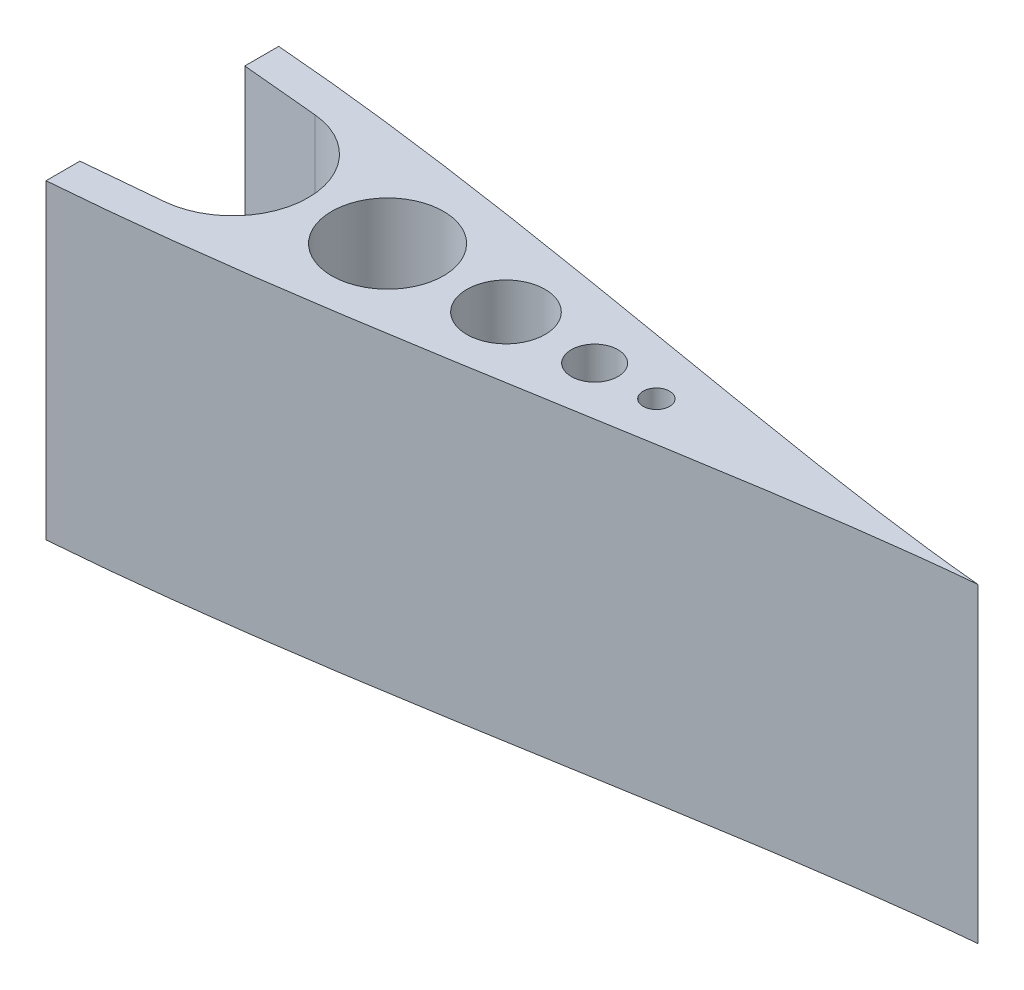
ISO-10303-21;
HEADER;
FILE_DESCRIPTION(('STEP AP214'),'2;1');
FILE_NAME('part.step','',(''),(''),'','','');
FILE_SCHEMA(('AUTOMOTIVE_DESIGN { 1 0 10303 214 1 1 1 1 }'));
ENDSEC;
DATA;
#1=APPLICATION_CONTEXT('core data for automotive mechanical design processes');
#2=APPLICATION_PROTOCOL_DEFINITION('international standard','automotive_design',2000,#1);
#3=PRODUCT_CONTEXT('',#1,'mechanical');
#4=PRODUCT('Part','Part','',(#3));
#5=PRODUCT_RELATED_PRODUCT_CATEGORY('part','',(#4));
#6=PRODUCT_DEFINITION_FORMATION('','',#4);
#7=PRODUCT_DEFINITION_CONTEXT('part definition',#1,'design');
#8=PRODUCT_DEFINITION('design','',#6,#7);
#9=PRODUCT_DEFINITION_SHAPE('','',#8);
#10=(LENGTH_UNIT() NAMED_UNIT(*) SI_UNIT(.MILLI.,.METRE.));
#11=(NAMED_UNIT(*) PLANE_ANGLE_UNIT() SI_UNIT($,.RADIAN.));
#12=(NAMED_UNIT(*) SI_UNIT($,.STERADIAN.) SOLID_ANGLE_UNIT());
#13=UNCERTAINTY_MEASURE_WITH_UNIT(LENGTH_MEASURE(1.E-05),#10,'distance_accuracy_value','');
#14=(GEOMETRIC_REPRESENTATION_CONTEXT(3) GLOBAL_UNCERTAINTY_ASSIGNED_CONTEXT((#13)) GLOBAL_UNIT_ASSIGNED_CONTEXT((#10,
#11,#12)) REPRESENTATION_CONTEXT('',''));
#15=CARTESIAN_POINT('',(0.,0.,0.));
#16=DIRECTION('',(0.,0.,1.));
#17=DIRECTION('',(1.,0.,0.));
#18=AXIS2_PLACEMENT_3D('',#15,#16,#17);
#19=CARTESIAN_POINT('',(1.01618101339085,50.8,-10.8993353954497));
#20=DIRECTION('',(0.0928307105141878,0.,-0.995681906627525));
#21=DIRECTION('',(-0.995681906627525,0.,-0.0928307105141878));
#22=AXIS2_PLACEMENT_3D('',#19,#20,#21);
#23=PLANE('',#22);
#24=DIRECTION('',(0.995681906627525,0.,0.0928307105141878));
#25=VECTOR('',#24,1.);
#26=CARTESIAN_POINT('',(1.01618101339085,50.8,-10.8993353954497));
#27=LINE('',#26,#25);
#28=CARTESIAN_POINT('',(-26.4729833951407,50.8,-13.4622409243139));
#29=VERTEX_POINT('',#28);
#30=CARTESIAN_POINT('',(-13.8473201339051,50.8,-12.2851086660569));
#31=VERTEX_POINT('',#30);
#32=EDGE_CURVE('E156',#29,#31,#27,.T.);
#33=ORIENTED_EDGE('',*,*,#32,.F.);
#34=DIRECTION('',(0.,-1.,0.));
#35=VECTOR('',#34,1.);
#36=CARTESIAN_POINT('',(-26.4729833951407,50.8,-13.4622409243139));
#37=LINE('',#36,#35);
#38=CARTESIAN_POINT('',(-26.4729833951407,0.,-13.4622409243139));
#39=VERTEX_POINT('',#38);
#40=EDGE_CURVE('E222',#29,#39,#37,.T.);
#41=ORIENTED_EDGE('',*,*,#40,.T.);
#42=DIRECTION('',(0.995681906627525,0.,0.0928307105141878));
#43=VECTOR('',#42,1.);
#44=CARTESIAN_POINT('',(1.01618101339085,0.,-10.8993353954496));
#45=LINE('',#44,#43);
#46=CARTESIAN_POINT('',(-13.8473201339051,0.,-12.2851086660568));
#47=VERTEX_POINT('',#46);
#48=EDGE_CURVE('E256',#39,#47,#45,.T.);
#49=ORIENTED_EDGE('',*,*,#48,.T.);
#50=DIRECTION('',(0.,-1.,0.));
#51=VECTOR('',#50,1.);
#52=CARTESIAN_POINT('',(-13.8473201339051,50.8,-12.2851086660569));
#53=LINE('',#52,#51);
#54=EDGE_CURVE('E69',#31,#47,#53,.T.);
#55=ORIENTED_EDGE('',*,*,#54,.F.);
#56=EDGE_LOOP('',(#33,#41,#49,#55));
#57=FACE_BOUND('',#56,.T.);
#58=ADVANCED_FACE('F57',(#57),#23,.F.);
#59=CARTESIAN_POINT('',(-14.9927013632145,50.8,1.11022302462516E-13));
#60=DIRECTION('',(0.,-1.,0.));
#61=DIRECTION('',(0.,0.,-0.999999999999996));
#62=AXIS2_PLACEMENT_3D('',#59,#60,#61);
#63=CYLINDRICAL_SURFACE('',#62,12.338386973073);
#64=CARTESIAN_POINT('',(-14.9927013632145,0.,2.22044604925031E-13));
#65=DIRECTION('',(0.,1.,0.));
#66=DIRECTION('',(0.,0.,0.999999999999996));
#67=AXIS2_PLACEMENT_3D('',#64,#65,#66);
#68=CIRCLE('',#67,12.338386973073);
#69=CARTESIAN_POINT('',(-13.8473201339051,0.,12.285108666058));
#70=VERTEX_POINT('',#69);
#71=EDGE_CURVE('E261',#70,#47,#68,.T.);
#72=ORIENTED_EDGE('',*,*,#71,.F.);
#73=DIRECTION('',(0.,-1.,0.));
#74=VECTOR('',#73,1.);
#75=CARTESIAN_POINT('',(-13.8473201339051,50.8,12.285108666058));
#76=LINE('',#75,#74);
#77=CARTESIAN_POINT('',(-13.8473201339051,50.8,12.285108666058));
#78=VERTEX_POINT('',#77);
#79=EDGE_CURVE('E283',#78,#70,#76,.T.);
#80=ORIENTED_EDGE('',*,*,#79,.F.);
#81=CARTESIAN_POINT('',(-14.9927013632145,50.8,1.11022302462516E-13));
#82=DIRECTION('',(0.,1.,0.));
#83=DIRECTION('',(0.,0.,0.999999999999996));
#84=AXIS2_PLACEMENT_3D('',#81,#82,#83);
#85=CIRCLE('',#84,12.338386973073);
#86=EDGE_CURVE('E162',#78,#31,#85,.T.);
#87=ORIENTED_EDGE('',*,*,#86,.T.);
#88=ORIENTED_EDGE('',*,*,#54,.T.);
#89=EDGE_LOOP('',(#72,#80,#87,#88));
#90=FACE_BOUND('',#89,.T.);
#91=ADVANCED_FACE('F184',(#90),#63,.F.);
#92=CARTESIAN_POINT('',(-106.482983395141,50.7999999999982,-7.35533856044412E-09));
#93=CARTESIAN_POINT('',(-106.481988205194,50.7999999999982,-0.336221446681662));
#94=CARTESIAN_POINT('',(-106.427915569481,50.7999999999982,-1.17247085156813));
#95=CARTESIAN_POINT('',(-106.10595146375,50.7999999999982,-2.6430992686044));
#96=CARTESIAN_POINT('',(-105.314009735291,50.7999999999982,-4.47521740831969));
#97=CARTESIAN_POINT('',(-103.897531118637,50.8,-6.50434841864356));
#98=CARTESIAN_POINT('',(-101.808045378182,50.8,-8.57165133235616));
#99=CARTESIAN_POINT('',(-99.0667178405011,50.8,-10.5675567036547));
#100=CARTESIAN_POINT('',(-95.7198031883861,50.8,-12.426747299612));
#101=CARTESIAN_POINT('',(-91.8173324289491,50.8,-14.1114417112691));
#102=CARTESIAN_POINT('',(-87.4067018354754,50.8,-15.5993181619846));
#103=CARTESIAN_POINT('',(-82.5319070115307,50.8,-16.8771333229446));
#104=CARTESIAN_POINT('',(-77.2341496539681,50.8,-17.9374356197232));
#105=CARTESIAN_POINT('',(-71.5526070979118,50.8,-18.7767405724212));
#106=CARTESIAN_POINT('',(-65.5251476056236,50.8,-19.3954605858547));
#107=CARTESIAN_POINT('',(-59.1885914175652,50.8,-19.7965740301131));
#108=CARTESIAN_POINT('',(-52.579053079844,50.8,-19.9862763161063));
#109=CARTESIAN_POINT('',(-45.7320019639345,50.8,-19.9728658373548));
#110=CARTESIAN_POINT('',(-38.6823636938902,50.8,-19.7673224697509));
#111=CARTESIAN_POINT('',(-31.4645229280412,50.8,-19.3825524779141));
#112=CARTESIAN_POINT('',(-24.1123351486456,50.8,-18.8333174672901));
#113=CARTESIAN_POINT('',(-16.6591158210678,50.8,-18.1360009675589));
#114=CARTESIAN_POINT('',(-9.13763404320478,50.8,-17.308302016677));
#115=CARTESIAN_POINT('',(-1.58011288129378,50.8,-16.3689060143236));
#116=CARTESIAN_POINT('',(5.98177290974777,50.8,-15.3372135342326));
#117=CARTESIAN_POINT('',(13.5168910285406,50.8,-14.2329994071519));
#118=CARTESIAN_POINT('',(20.9946456094976,50.8,-13.0761298482216));
#119=CARTESIAN_POINT('',(28.3849687391637,50.8,-11.8862100008003));
#120=CARTESIAN_POINT('',(35.6583232509189,50.8,-10.6823363143879));
#121=CARTESIAN_POINT('',(42.7857029072654,50.8,-9.4827591236365));
#122=CARTESIAN_POINT('',(49.7386474254295,50.8,-8.30463778684765));
#123=CARTESIAN_POINT('',(56.4892656841134,50.8,-7.16376071809477));
#124=CARTESIAN_POINT('',(63.0102811144397,50.8,-6.07435669901413));
#125=CARTESIAN_POINT('',(69.2750767276782,50.8,-5.04884141157258));
#126=CARTESIAN_POINT('',(75.2577811056108,50.8,-4.09769207062749));
#127=CARTESIAN_POINT('',(80.9333433114543,50.8,-3.22931724888953));
#128=CARTESIAN_POINT('',(86.2776693757115,50.8,-2.44984621283506));
#129=CARTESIAN_POINT('',(91.2676183232579,50.8,-1.76329204938785));
#130=CARTESIAN_POINT('',(95.881607116401,50.8,-1.1712247595822));
#131=CARTESIAN_POINT('',(100.098099776026,50.8,-0.67311916377033));
#132=CARTESIAN_POINT('',(103.673185129137,50.8,-0.290516392494555));
#133=CARTESIAN_POINT('',(105.83614121967,50.8,-0.0817456538573236));
#134=CARTESIAN_POINT('',(106.733370690552,50.8,-7.30038252072518E-09));
#135=B_SPLINE_CURVE_WITH_KNOTS('',3,(#92,#93,#94,#95,#96,#97,#98,#99,#100,#101,#102,#103,#104,
#105,#106,#107,#108,#109,#110,#111,#112,#113,#114,#115,#116,#117,#118,#119,#120,#121,#122,#123,
#124,#125,#126,#127,#128,#129,#130,#131,#132,#133,#134),.UNSPECIFIED.,.F.,.F.,(4,1,1,1,1,1,1,1,
1,1,1,1,1,1,1,1,1,1,1,1,1,1,1,1,1,1,1,1,1,1,1,1,1,1,1,1,1,1,1,1,4),(0.5,0.502166768562745,
0.505390167385713,0.509655974305835,0.514947681887198,0.521244711429097,0.528520886222697,
0.536744945012688,0.545881360311019,0.555890751085959,0.566730118512969,0.578352990409744,
0.59070958813284,0.603747039427916,0.617409572172202,0.631638768029288,0.646373793426418,
0.66155165817642,0.677107482822761,0.692974771091203,0.709085712601986,0.725371443301651,
0.741762353139131,0.758188398075751,0.774579367488477,0.790865214368963,0.806976331929698,
0.822843867373426,0.838400001999155,0.853578261502887,0.868313774347479,0.882543568085681,
0.896206835422454,0.909245173309164,0.921602869650348,0.933227116385514,0.944068236336681,
0.954079898096736,0.963219316327445,0.971447444986932,0.977251073986684),.UNSPECIFIED.);
#136=DIRECTION('',(0.,-1.,0.));
#137=VECTOR('',#136,1.);
#138=SURFACE_OF_LINEAR_EXTRUSION('',#135,#137);
#139=DIRECTION('',(0.,-1.,0.));
#140=VECTOR('',#139,1.);
#141=CARTESIAN_POINT('',(-26.4729833951411,25.4000000000001,-19.0014780591534));
#142=LINE('',#141,#140);
#143=CARTESIAN_POINT('',(-26.4729834006801,0.,-19.001478059586));
#144=VERTEX_POINT('',#143);
#145=CARTESIAN_POINT('',(-26.4729833951411,50.8,-19.0014780591534));
#146=VERTEX_POINT('',#145);
#147=EDGE_CURVE('E91',#144,#146,#142,.F.);
#148=ORIENTED_EDGE('',*,*,#147,.T.);
#149=CARTESIAN_POINT('',(106.733370690552,50.8,7.30038252072518E-09));
#150=VERTEX_POINT('',#149);
#151=EDGE_CURVE('E157',#146,#150,#135,.T.);
#152=ORIENTED_EDGE('',*,*,#151,.T.);
#153=DIRECTION('',(0.,-1.,0.));
#154=VECTOR('',#153,1.);
#155=CARTESIAN_POINT('',(106.733370690552,50.8,7.30038252072518E-09));
#156=LINE('',#155,#154);
#157=CARTESIAN_POINT('',(106.733370690552,0.,7.30038252072518E-09));
#158=VERTEX_POINT('',#157);
#159=EDGE_CURVE('E154',#150,#158,#156,.T.);
#160=ORIENTED_EDGE('',*,*,#159,.T.);
#161=CARTESIAN_POINT('',(-106.482983395141,-1.77635683940025E-12,-7.35522753814166E-09));
#162=CARTESIAN_POINT('',(-106.481988205194,-1.77635683940025E-12,-0.336221446681662));
#163=CARTESIAN_POINT('',(-106.427915569481,-1.77635683940025E-12,-1.17247085156802));
#164=CARTESIAN_POINT('',(-106.10595146375,-1.77635683940025E-12,-2.64309926860395));
#165=CARTESIAN_POINT('',(-105.314009735291,-1.77635683940025E-12,-4.47521740831969));
#166=CARTESIAN_POINT('',(-103.897531118637,0.,-6.50434841864345));
#167=CARTESIAN_POINT('',(-101.808045378182,0.,-8.57165133235604));
#168=CARTESIAN_POINT('',(-99.0667178405011,0.,-10.5675567036547));
#169=CARTESIAN_POINT('',(-95.7198031883861,0.,-12.426747299612));
#170=CARTESIAN_POINT('',(-91.8173324289491,0.,-14.1114417112691));
#171=CARTESIAN_POINT('',(-87.4067018354754,0.,-15.5993181619846));
#172=CARTESIAN_POINT('',(-82.5319070115305,0.,-16.8771333229443));
#173=CARTESIAN_POINT('',(-77.2341496539681,0.,-17.9374356197232));
#174=CARTESIAN_POINT('',(-71.5526070979118,0.,-18.7767405724212));
#175=CARTESIAN_POINT('',(-65.5251476056236,0.,-19.3954605858545));
#176=CARTESIAN_POINT('',(-59.1885914175652,0.,-19.7965740301131));
#177=CARTESIAN_POINT('',(-52.579053079844,0.,-19.9862763161058));
#178=CARTESIAN_POINT('',(-45.7320019639345,0.,-19.9728658373548));
#179=CARTESIAN_POINT('',(-38.6823636938902,0.,-19.7673224697509));
#180=CARTESIAN_POINT('',(-31.4645229280412,0.,-19.3825524779141));
#181=CARTESIAN_POINT('',(-24.1123351486452,0.,-18.83331746729));
#182=CARTESIAN_POINT('',(-16.6591158210678,0.,-18.1360009675589));
#183=CARTESIAN_POINT('',(-9.13763404320478,0.,-17.308302016677));
#184=CARTESIAN_POINT('',(-1.58011288129378,0.,-16.3689060143236));
#185=CARTESIAN_POINT('',(5.98177290974777,0.,-15.3372135342325));
#186=CARTESIAN_POINT('',(13.5168910285401,0.,-14.2329994071518));
#187=CARTESIAN_POINT('',(20.9946456094976,0.,-13.0761298482215));
#188=CARTESIAN_POINT('',(28.3849687391635,0.,-11.8862100008));
#189=CARTESIAN_POINT('',(35.6583232509193,0.,-10.6823363143879));
#190=CARTESIAN_POINT('',(42.7857029072654,0.,-9.4827591236365));
#191=CARTESIAN_POINT('',(49.7386474254298,0.,-8.30463778684754));
#192=CARTESIAN_POINT('',(56.4892656841134,0.,-7.16376071809466));
#193=CARTESIAN_POINT('',(63.01028111444,0.,-6.07435669901402));
#194=CARTESIAN_POINT('',(69.2750767276782,0.,-5.04884141157258));
#195=CARTESIAN_POINT('',(75.2577811056108,0.,-4.09769207062749));
#196=CARTESIAN_POINT('',(80.9333433114541,0.,-3.22931724888953));
#197=CARTESIAN_POINT('',(86.2776693757115,0.,-2.44984621283506));
#198=CARTESIAN_POINT('',(91.2676183232581,0.,-1.76329204938763));
#199=CARTESIAN_POINT('',(95.881607116401,0.,-1.1712247595822));
#200=CARTESIAN_POINT('',(100.098099776026,0.,-0.67311916377033));
#201=CARTESIAN_POINT('',(103.673185129137,0.,-0.290516392494555));
#202=CARTESIAN_POINT('',(105.83614121967,0.,-0.0817456538576566));
#203=CARTESIAN_POINT('',(106.733370690552,0.,-7.30038252072518E-09));
#204=B_SPLINE_CURVE_WITH_KNOTS('',3,(#161,#162,#163,#164,#165,#166,#167,#168,#169,#170,#171,
#172,#173,#174,#175,#176,#177,#178,#179,#180,#181,#182,#183,#184,#185,#186,#187,#188,#189,#190,
#191,#192,#193,#194,#195,#196,#197,#198,#199,#200,#201,#202,#203),.UNSPECIFIED.,.F.,.F.,(4,1,1,
1,1,1,1,1,1,1,1,1,1,1,1,1,1,1,1,1,1,1,1,1,1,1,1,1,1,1,1,1,1,1,1,1,1,1,1,1,4),(0.5,
0.502166768562745,0.505390167385713,0.509655974305835,0.514947681887198,0.521244711429097,
0.528520886222697,0.536744945012688,0.545881360311019,0.555890751085959,0.566730118512969,
0.578352990409744,0.59070958813284,0.603747039427916,0.617409572172202,0.631638768029288,
0.646373793426418,0.66155165817642,0.677107482822761,0.692974771091203,0.709085712601986,
0.725371443301651,0.741762353139131,0.758188398075751,0.774579367488477,0.790865214368963,
0.806976331929698,0.822843867373426,0.838400001999155,0.853578261502887,0.868313774347479,
0.882543568085681,0.896206835422454,0.909245173309164,0.921602869650348,0.933227116385514,
0.944068236336681,0.954079898096736,0.963219316327445,0.971447444986932,0.977251073986684),.UNSPECIFIED.);
#205=EDGE_CURVE('E228',#144,#158,#204,.T.);
#206=ORIENTED_EDGE('',*,*,#205,.F.);
#207=EDGE_LOOP('',(#148,#152,#160,#206));
#208=FACE_BOUND('',#207,.T.);
#209=ADVANCED_FACE('F59',(#208),#138,.T.);
#210=CARTESIAN_POINT('',(44.126269566956,50.8,0.));
#211=DIRECTION('',(0.,-1.,0.));
#212=DIRECTION('',(0.,0.,-0.999999999999996));
#213=AXIS2_PLACEMENT_3D('',#210,#211,#212);
#214=CYLINDRICAL_SURFACE('',#213,3.80999999961901);
#215=CARTESIAN_POINT('',(44.126269566956,50.8,0.));
#216=DIRECTION('',(0.,1.,0.));
#217=DIRECTION('',(0.,0.,0.999999999999996));
#218=AXIS2_PLACEMENT_3D('',#215,#216,#217);
#219=CIRCLE('',#218,3.80999999961901);
#220=CARTESIAN_POINT('',(44.126269566956,50.8,3.80999999961899));
#221=VERTEX_POINT('',#220);
#222=EDGE_CURVE('E307',#221,#221,#219,.T.);
#223=ORIENTED_EDGE('',*,*,#222,.T.);
#224=EDGE_LOOP('',(#223));
#225=FACE_BOUND('',#224,.T.);
#226=CARTESIAN_POINT('',(44.1262695669558,0.,6.66133814775094E-13));
#227=DIRECTION('',(0.,1.,0.));
#228=DIRECTION('',(0.,0.,0.999999999999996));
#229=AXIS2_PLACEMENT_3D('',#226,#227,#228);
#230=CIRCLE('',#229,3.80999999961901);
#231=CARTESIAN_POINT('',(44.1262695669558,0.,3.80999999961966));
#232=VERTEX_POINT('',#231);
#233=EDGE_CURVE('E276',#232,#232,#230,.T.);
#234=ORIENTED_EDGE('',*,*,#233,.F.);
#235=EDGE_LOOP('',(#234));
#236=FACE_BOUND('',#235,.T.);
#237=ADVANCED_FACE('F199',(#225,#236),#214,.F.);
#238=CARTESIAN_POINT('',(29.6435174290042,50.8,6.66133814775094E-13));
#239=DIRECTION('',(0.,-1.,0.));
#240=DIRECTION('',(0.,0.,-0.999999999999996));
#241=AXIS2_PLACEMENT_3D('',#238,#239,#240);
#242=CYLINDRICAL_SURFACE('',#241,6.39233333269412);
#243=CARTESIAN_POINT('',(29.6435174290042,50.8,6.66133814775094E-13));
#244=DIRECTION('',(0.,1.,0.));
#245=DIRECTION('',(0.,0.,0.999999999999996));
#246=AXIS2_PLACEMENT_3D('',#243,#244,#245);
#247=CIRCLE('',#246,6.39233333269412);
#248=CARTESIAN_POINT('',(29.6435174290042,50.8,6.39233333269476));
#249=VERTEX_POINT('',#248);
#250=EDGE_CURVE('E304',#249,#249,#247,.T.);
#251=ORIENTED_EDGE('',*,*,#250,.T.);
#252=EDGE_LOOP('',(#251));
#253=FACE_BOUND('',#252,.T.);
#254=CARTESIAN_POINT('',(29.6435174290044,0.,8.88178419700125E-13));
#255=DIRECTION('',(0.,1.,0.));
#256=DIRECTION('',(0.,0.,0.999999999999996));
#257=AXIS2_PLACEMENT_3D('',#254,#255,#256);
#258=CIRCLE('',#257,6.39233333269412);
#259=CARTESIAN_POINT('',(29.6435174290044,0.,6.39233333269498));
#260=VERTEX_POINT('',#259);
#261=EDGE_CURVE('E272',#260,#260,#258,.T.);
#262=ORIENTED_EDGE('',*,*,#261,.F.);
#263=EDGE_LOOP('',(#262));
#264=FACE_BOUND('',#263,.T.);
#265=ADVANCED_FACE('F195',(#253,#264),#242,.F.);
#266=CARTESIAN_POINT('',(10.3101726344372,50.8,7.7715611723761E-13));
#267=DIRECTION('',(0.,-1.,0.));
#268=DIRECTION('',(0.,0.,-0.999999999999996));
#269=AXIS2_PLACEMENT_3D('',#266,#267,#268);
#270=CYLINDRICAL_SURFACE('',#269,9.13101146225404);
#271=CARTESIAN_POINT('',(10.3101726344372,50.8,7.7715611723761E-13));
#272=DIRECTION('',(0.,1.,0.));
#273=DIRECTION('',(0.,0.,0.999999999999996));
#274=AXIS2_PLACEMENT_3D('',#271,#272,#273);
#275=CIRCLE('',#274,9.13101146225404);
#276=CARTESIAN_POINT('',(10.3101726344372,50.8,9.13101146225478));
#277=VERTEX_POINT('',#276);
#278=EDGE_CURVE('E299',#277,#277,#275,.T.);
#279=ORIENTED_EDGE('',*,*,#278,.T.);
#280=EDGE_LOOP('',(#279));
#281=FACE_BOUND('',#280,.T.);
#282=CARTESIAN_POINT('',(10.3101726344372,0.,8.88178419700125E-13));
#283=DIRECTION('',(0.,1.,0.));
#284=DIRECTION('',(0.,0.,0.999999999999996));
#285=AXIS2_PLACEMENT_3D('',#282,#283,#284);
#286=CIRCLE('',#285,9.13101146225404);
#287=CARTESIAN_POINT('',(10.3101726344372,0.,9.13101146225489));
#288=VERTEX_POINT('',#287);
#289=EDGE_CURVE('E268',#288,#288,#286,.T.);
#290=ORIENTED_EDGE('',*,*,#289,.F.);
#291=EDGE_LOOP('',(#290));
#292=FACE_BOUND('',#291,.T.);
#293=ADVANCED_FACE('F191',(#281,#292),#270,.F.);
#294=CARTESIAN_POINT('',(1.01618101339129,50.8,10.8993353954501));
#295=DIRECTION('',(-0.092830710514188,0.,-0.995681906627525));
#296=DIRECTION('',(-0.995681906627525,0.,0.0928307105141881));
#297=AXIS2_PLACEMENT_3D('',#294,#295,#296);
#298=PLANE('',#297);
#299=DIRECTION('',(0.,-1.,0.));
#300=VECTOR('',#299,1.);
#301=CARTESIAN_POINT('',(-26.4729833951414,50.8,13.4622409243143));
#302=LINE('',#301,#300);
#303=CARTESIAN_POINT('',(-26.4729833951414,50.8,13.4622409243143));
#304=VERTEX_POINT('',#303);
#305=CARTESIAN_POINT('',(-26.4729833951414,0.,13.4622409243145));
#306=VERTEX_POINT('',#305);
#307=EDGE_CURVE('E80',#304,#306,#302,.T.);
#308=ORIENTED_EDGE('',*,*,#307,.F.);
#309=DIRECTION('',(0.995681906627525,0.,-0.092830710514188));
#310=VECTOR('',#309,1.);
#311=CARTESIAN_POINT('',(1.01618101339129,50.8,10.8993353954501));
#312=LINE('',#311,#310);
#313=EDGE_CURVE('E149',#304,#78,#312,.T.);
#314=ORIENTED_EDGE('',*,*,#313,.T.);
#315=ORIENTED_EDGE('',*,*,#79,.T.);
#316=DIRECTION('',(0.995681906627525,0.,-0.092830710514188));
#317=VECTOR('',#316,1.);
#318=CARTESIAN_POINT('',(1.01618101339129,0.,10.8993353954501));
#319=LINE('',#318,#317);
#320=EDGE_CURVE('E265',#306,#70,#319,.T.);
#321=ORIENTED_EDGE('',*,*,#320,.F.);
#322=EDGE_LOOP('',(#308,#314,#315,#321));
#323=FACE_BOUND('',#322,.T.);
#324=ADVANCED_FACE('F181',(#323),#298,.T.);
#325=CARTESIAN_POINT('',(-106.4829833948,50.7999999999982,7.35556060504905E-09));
#326=CARTESIAN_POINT('',(-106.481988204852,50.7999999999982,0.336221446681328));
#327=CARTESIAN_POINT('',(-106.42791556914,50.7999999999982,1.17247085156702));
#328=CARTESIAN_POINT('',(-106.10595146341,50.7999999999982,2.64309926860051));
#329=CARTESIAN_POINT('',(-105.314009734951,50.7999999999982,4.47521740831258));
#330=CARTESIAN_POINT('',(-103.8975311183,50.7999999999982,6.50434841863345));
#331=CARTESIAN_POINT('',(-101.808045377848,50.7999999999982,8.57165133234239));
#332=CARTESIAN_POINT('',(-99.0667178401716,50.7999999999982,10.5675567036381));
#333=CARTESIAN_POINT('',(-95.7198031880633,50.7999999999982,12.426747299593));
#334=CARTESIAN_POINT('',(-91.8173324286315,50.7999999999982,14.1114417112466));
#335=CARTESIAN_POINT('',(-87.4067018351652,50.7999999999982,15.5993181619604));
#336=CARTESIAN_POINT('',(-82.5319070112276,50.7999999999982,16.8771333229183));
#337=CARTESIAN_POINT('',(-77.2341496536739,50.7999999999982,17.9374356196945));
#338=CARTESIAN_POINT('',(-71.5526070976253,50.7999999999982,18.7767405723922));
#339=CARTESIAN_POINT('',(-65.5251476053478,50.7999999999982,19.3954605858242));
#340=CARTESIAN_POINT('',(-59.1885914172996,50.7999999999982,19.7965740300823));
#341=CARTESIAN_POINT('',(-52.5790530795891,50.7999999999982,19.9862763160749));
#342=CARTESIAN_POINT('',(-45.7320019636904,50.8,19.9728658373232));
#343=CARTESIAN_POINT('',(-38.6823636936573,50.8,19.7673224697195));
#344=CARTESIAN_POINT('',(-31.4645229278203,50.8,19.3825524778835));
#345=CARTESIAN_POINT('',(-24.112335148436,50.8,18.8333174672601));
#346=CARTESIAN_POINT('',(-16.6591158208707,50.8,18.1360009675307));
#347=CARTESIAN_POINT('',(-9.13763404301937,50.8,17.30830201665));
#348=CARTESIAN_POINT('',(-1.58011288111992,50.8,16.3689060142985));
#349=CARTESIAN_POINT('',(5.98177290990942,50.8,15.3372135342084));
#350=CARTESIAN_POINT('',(13.5168910286894,50.8,14.2329994071303));
#351=CARTESIAN_POINT('',(20.9946456096346,50.8,13.0761298482011));
#352=CARTESIAN_POINT('',(28.384968739289,50.8,11.8862100007814));
#353=CARTESIAN_POINT('',(35.6583232510328,50.8,10.6823363143721));
#354=CARTESIAN_POINT('',(42.7857029073675,50.8,9.48275912362195));
#355=CARTESIAN_POINT('',(49.7386474255213,50.8,8.30463778683477));
#356=CARTESIAN_POINT('',(56.4892656841933,50.8,7.16376071808367));
#357=CARTESIAN_POINT('',(63.0102811145106,50.8,6.07435669900491));
#358=CARTESIAN_POINT('',(69.2750767277386,50.8,5.04884141156459));
#359=CARTESIAN_POINT('',(75.2577811056614,50.8,4.09769207062138));
#360=CARTESIAN_POINT('',(80.9333433114949,50.8,3.22931724888509));
#361=CARTESIAN_POINT('',(86.2776693757443,50.8,2.4498462128314));
#362=CARTESIAN_POINT('',(91.2676183232837,50.8,1.76329204938563));
#363=CARTESIAN_POINT('',(95.8816071164188,50.8,1.17122475958042));
#364=CARTESIAN_POINT('',(100.098099776037,50.8,0.673119163769997));
#365=CARTESIAN_POINT('',(103.673185129142,50.8,0.290516392494111));
#366=CARTESIAN_POINT('',(105.836141219672,50.8,0.0817456538579897));
#367=CARTESIAN_POINT('',(106.733370690552,50.8,7.30038252072518E-09));
#368=B_SPLINE_CURVE_WITH_KNOTS('',3,(#325,#326,#327,#328,#329,#330,#331,#332,#333,#334,#335,
#336,#337,#338,#339,#340,#341,#342,#343,#344,#345,#346,#347,#348,#349,#350,#351,#352,#353,#354,
#355,#356,#357,#358,#359,#360,#361,#362,#363,#364,#365,#366,#367),.UNSPECIFIED.,.F.,.F.,(4,1,1,
1,1,1,1,1,1,1,1,1,1,1,1,1,1,1,1,1,1,1,1,1,1,1,1,1,1,1,1,1,1,1,1,1,1,1,1,1,4),(0.5,
0.502166768562745,0.505390167385713,0.509655974305835,0.514947681887198,0.521244711429097,
0.528520886222697,0.536744945012688,0.545881360311019,0.555890751085959,0.566730118512969,
0.578352990409744,0.59070958813284,0.603747039427916,0.617409572172202,0.631638768029288,
0.646373793426418,0.66155165817642,0.677107482822761,0.692974771091203,0.709085712601986,
0.725371443301651,0.741762353139131,0.758188398075751,0.774579367488477,0.790865214368963,
0.806976331929698,0.822843867373426,0.838400001999155,0.853578261502887,0.868313774347479,
0.882543568085681,0.896206835422454,0.909245173309164,0.921602869650348,0.933227116385514,
0.944068236336681,0.954079898096736,0.963219316327445,0.971447444986932,0.977251073986684),.UNSPECIFIED.);
#369=DIRECTION('',(0.,-1.,0.));
#370=VECTOR('',#369,1.);
#371=SURFACE_OF_LINEAR_EXTRUSION('',#368,#370);
#372=CARTESIAN_POINT('',(-26.4729833951407,50.8,19.0014780591403));
#373=VERTEX_POINT('',#372);
#374=EDGE_CURVE('E146',#373,#150,#368,.T.);
#375=ORIENTED_EDGE('',*,*,#374,.F.);
#376=DIRECTION('',(0.,-1.,0.));
#377=VECTOR('',#376,1.);
#378=CARTESIAN_POINT('',(-26.4729833951407,25.4000000000001,19.0014780591403));
#379=LINE('',#378,#377);
#380=CARTESIAN_POINT('',(-26.4729833951407,0.,19.0014780591403));
#381=VERTEX_POINT('',#380);
#382=EDGE_CURVE('E131',#381,#373,#379,.F.);
#383=ORIENTED_EDGE('',*,*,#382,.F.);
#384=CARTESIAN_POINT('',(-106.4829833948,-1.77635683940025E-12,7.35556060504905E-09));
#385=CARTESIAN_POINT('',(-106.481988204852,-1.77635683940025E-12,0.336221446682328));
#386=CARTESIAN_POINT('',(-106.42791556914,-1.77635683940025E-12,1.17247085156702));
#387=CARTESIAN_POINT('',(-106.10595146341,-1.77635683940025E-12,2.64309926860051));
#388=CARTESIAN_POINT('',(-105.314009734951,-1.77635683940025E-12,4.47521740831258));
#389=CARTESIAN_POINT('',(-103.8975311183,-1.77635683940025E-12,6.50434841863357));
#390=CARTESIAN_POINT('',(-101.808045377847,-1.77635683940025E-12,8.57165133234306));
#391=CARTESIAN_POINT('',(-99.0667178401716,-1.77635683940025E-12,10.5675567036381));
#392=CARTESIAN_POINT('',(-95.7198031880628,-1.77635683940025E-12,12.4267472995933));
#393=CARTESIAN_POINT('',(-91.8173324286315,-1.77635683940025E-12,14.1114417112466));
#394=CARTESIAN_POINT('',(-87.4067018351652,-1.77635683940025E-12,15.5993181619605));
#395=CARTESIAN_POINT('',(-82.5319070112265,-1.77635683940025E-12,16.8771333229188));
#396=CARTESIAN_POINT('',(-77.2341496536739,-1.77635683940025E-12,17.9374356196945));
#397=CARTESIAN_POINT('',(-71.5526070976253,-1.77635683940025E-12,18.7767405723922));
#398=CARTESIAN_POINT('',(-65.5251476053473,-1.77635683940025E-12,19.3954605858245));
#399=CARTESIAN_POINT('',(-59.1885914172996,-1.77635683940025E-12,19.7965740300823));
#400=CARTESIAN_POINT('',(-52.5790530795891,-1.77635683940025E-12,19.9862763160749));
#401=CARTESIAN_POINT('',(-45.7320019636904,0.,19.9728658373237));
#402=CARTESIAN_POINT('',(-38.6823636936573,0.,19.7673224697197));
#403=CARTESIAN_POINT('',(-31.4645229278203,0.,19.3825524778835));
#404=CARTESIAN_POINT('',(-24.112335148436,0.,18.8333174672601));
#405=CARTESIAN_POINT('',(-16.6591158208707,0.,18.1360009675307));
#406=CARTESIAN_POINT('',(-9.13763404301959,0.,17.3083020166503));
#407=CARTESIAN_POINT('',(-1.58011288111992,0.,16.3689060142985));
#408=CARTESIAN_POINT('',(5.98177290990942,0.,15.3372135342085));
#409=CARTESIAN_POINT('',(13.5168910286894,0.,14.2329994071303));
#410=CARTESIAN_POINT('',(20.9946456096346,0.,13.0761298482011));
#411=CARTESIAN_POINT('',(28.384968739289,0.,11.8862100007815));
#412=CARTESIAN_POINT('',(35.6583232510328,0.,10.6823363143721));
#413=CARTESIAN_POINT('',(42.7857029073675,0.,9.48275912362195));
#414=CARTESIAN_POINT('',(49.7386474255204,0.,8.30463778683532));
#415=CARTESIAN_POINT('',(56.4892656841931,0.,7.16376071808389));
#416=CARTESIAN_POINT('',(63.0102811145108,0.,6.07435669900513));
#417=CARTESIAN_POINT('',(69.2750767277384,0.,5.04884141156459));
#418=CARTESIAN_POINT('',(75.2577811056614,0.,4.09769207062138));
#419=CARTESIAN_POINT('',(80.9333433114949,0.,3.22931724888509));
#420=CARTESIAN_POINT('',(86.2776693757443,0.,2.4498462128314));
#421=CARTESIAN_POINT('',(91.2676183232837,0.,1.76329204938563));
#422=CARTESIAN_POINT('',(95.8816071164188,0.,1.17122475958054));
#423=CARTESIAN_POINT('',(100.098099776037,0.,0.673119163769997));
#424=CARTESIAN_POINT('',(103.673185129142,0.,0.290516392494111));
#425=CARTESIAN_POINT('',(105.836141219672,0.,0.0817456538579897));
#426=CARTESIAN_POINT('',(106.733370690552,0.,7.30038252072518E-09));
#427=B_SPLINE_CURVE_WITH_KNOTS('',3,(#384,#385,#386,#387,#388,#389,#390,#391,#392,#393,#394,
#395,#396,#397,#398,#399,#400,#401,#402,#403,#404,#405,#406,#407,#408,#409,#410,#411,#412,#413,
#414,#415,#416,#417,#418,#419,#420,#421,#422,#423,#424,#425,#426),.UNSPECIFIED.,.F.,.F.,(4,1,1,
1,1,1,1,1,1,1,1,1,1,1,1,1,1,1,1,1,1,1,1,1,1,1,1,1,1,1,1,1,1,1,1,1,1,1,1,1,4),(0.5,
0.502166768562745,0.505390167385713,0.509655974305835,0.514947681887198,0.521244711429097,
0.528520886222697,0.536744945012688,0.545881360311019,0.555890751085959,0.566730118512969,
0.578352990409744,0.59070958813284,0.603747039427916,0.617409572172202,0.631638768029288,
0.646373793426418,0.66155165817642,0.677107482822761,0.692974771091203,0.709085712601986,
0.725371443301651,0.741762353139131,0.758188398075751,0.774579367488477,0.790865214368963,
0.806976331929698,0.822843867373426,0.838400001999155,0.853578261502887,0.868313774347479,
0.882543568085681,0.896206835422454,0.909245173309164,0.921602869650348,0.933227116385514,
0.944068236336681,0.954079898096736,0.963219316327445,0.971447444986932,0.977251073986684),.UNSPECIFIED.);
#428=EDGE_CURVE('E240',#381,#158,#427,.T.);
#429=ORIENTED_EDGE('',*,*,#428,.T.);
#430=ORIENTED_EDGE('',*,*,#159,.F.);
#431=EDGE_LOOP('',(#375,#383,#429,#430));
#432=FACE_BOUND('',#431,.T.);
#433=ADVANCED_FACE('F152',(#432),#371,.F.);
#434=CARTESIAN_POINT('',(54.2103982242508,50.8,4.44089209850063E-13));
#435=DIRECTION('',(0.,-1.,0.));
#436=DIRECTION('',(0.,0.,-0.999999999999996));
#437=AXIS2_PLACEMENT_3D('',#434,#435,#436);
#438=CYLINDRICAL_SURFACE('',#437,2.15899999978409);
#439=CARTESIAN_POINT('',(54.2103982242508,50.8,4.44089209850063E-13));
#440=DIRECTION('',(0.,1.,0.));
#441=DIRECTION('',(0.,0.,0.999999999999996));
#442=AXIS2_PLACEMENT_3D('',#439,#440,#441);
#443=CIRCLE('',#442,2.15899999978409);
#444=CARTESIAN_POINT('',(54.2103982242508,50.8,2.15899999978452));
#445=VERTEX_POINT('',#444);
#446=EDGE_CURVE('E247',#445,#445,#443,.T.);
#447=ORIENTED_EDGE('',*,*,#446,.T.);
#448=EDGE_LOOP('',(#447));
#449=FACE_BOUND('',#448,.T.);
#450=CARTESIAN_POINT('',(54.2103982242506,0.,8.88178419700125E-13));
#451=DIRECTION('',(0.,1.,0.));
#452=DIRECTION('',(0.,0.,0.999999999999996));
#453=AXIS2_PLACEMENT_3D('',#450,#451,#452);
#454=CIRCLE('',#453,2.15899999978409);
#455=CARTESIAN_POINT('',(54.2103982242506,0.,2.15899999978497));
#456=VERTEX_POINT('',#455);
#457=EDGE_CURVE('E165',#456,#456,#454,.T.);
#458=ORIENTED_EDGE('',*,*,#457,.F.);
#459=EDGE_LOOP('',(#458));
#460=FACE_BOUND('',#459,.T.);
#461=ADVANCED_FACE('F180',(#449,#460),#438,.F.);
#462=CARTESIAN_POINT('',(0.,50.8,0.));
#463=DIRECTION('',(0.,1.,0.));
#464=DIRECTION('',(0.,0.,0.999999999999996));
#465=AXIS2_PLACEMENT_3D('',#462,#463,#464);
#466=PLANE('',#465);
#467=DIRECTION('',(0.,0.,-0.999999999999996));
#468=VECTOR('',#467,1.);
#469=CARTESIAN_POINT('',(-26.4729833951411,50.8,-19.0014780591534));
#470=LINE('',#469,#468);
#471=EDGE_CURVE('E134',#373,#304,#470,.T.);
#472=ORIENTED_EDGE('',*,*,#471,.F.);
#473=ORIENTED_EDGE('',*,*,#374,.T.);
#474=ORIENTED_EDGE('',*,*,#151,.F.);
#475=EDGE_CURVE('E62',#29,#146,#470,.T.);
#476=ORIENTED_EDGE('',*,*,#475,.F.);
#477=ORIENTED_EDGE('',*,*,#32,.T.);
#478=ORIENTED_EDGE('',*,*,#86,.F.);
#479=ORIENTED_EDGE('',*,*,#313,.F.);
#480=EDGE_LOOP('',(#472,#473,#474,#476,#477,#478,#479));
#481=FACE_BOUND('',#480,.T.);
#482=ORIENTED_EDGE('',*,*,#278,.F.);
#483=EDGE_LOOP('',(#482));
#484=FACE_BOUND('',#483,.T.);
#485=ORIENTED_EDGE('',*,*,#250,.F.);
#486=EDGE_LOOP('',(#485));
#487=FACE_BOUND('',#486,.T.);
#488=ORIENTED_EDGE('',*,*,#222,.F.);
#489=EDGE_LOOP('',(#488));
#490=FACE_BOUND('',#489,.T.);
#491=ORIENTED_EDGE('',*,*,#446,.F.);
#492=EDGE_LOOP('',(#491));
#493=FACE_BOUND('',#492,.T.);
#494=ADVANCED_FACE('F143',(#481,#484,#487,#490,#493),#466,.T.);
#495=CARTESIAN_POINT('',(0.,0.,0.));
#496=DIRECTION('',(0.,1.,0.));
#497=DIRECTION('',(0.,0.,0.999999999999996));
#498=AXIS2_PLACEMENT_3D('',#495,#496,#497);
#499=PLANE('',#498);
#500=ORIENTED_EDGE('',*,*,#428,.F.);
#501=DIRECTION('',(0.,0.,-0.999999999999996));
#502=VECTOR('',#501,1.);
#503=CARTESIAN_POINT('',(-26.4729833951411,0.,-19.0014780591534));
#504=LINE('',#503,#502);
#505=EDGE_CURVE('E135',#381,#306,#504,.T.);
#506=ORIENTED_EDGE('',*,*,#505,.T.);
#507=ORIENTED_EDGE('',*,*,#320,.T.);
#508=ORIENTED_EDGE('',*,*,#71,.T.);
#509=ORIENTED_EDGE('',*,*,#48,.F.);
#510=DIRECTION('',(0.,0.,-0.999999999999996));
#511=VECTOR('',#510,1.);
#512=CARTESIAN_POINT('',(-26.4729833951414,0.,7.7715611723761E-13));
#513=LINE('',#512,#511);
#514=EDGE_CURVE('E13',#39,#144,#513,.T.);
#515=ORIENTED_EDGE('',*,*,#514,.T.);
#516=ORIENTED_EDGE('',*,*,#205,.T.);
#517=EDGE_LOOP('',(#500,#506,#507,#508,#509,#515,#516));
#518=FACE_BOUND('',#517,.T.);
#519=ORIENTED_EDGE('',*,*,#289,.T.);
#520=EDGE_LOOP('',(#519));
#521=FACE_BOUND('',#520,.T.);
#522=ORIENTED_EDGE('',*,*,#261,.T.);
#523=EDGE_LOOP('',(#522));
#524=FACE_BOUND('',#523,.T.);
#525=ORIENTED_EDGE('',*,*,#233,.T.);
#526=EDGE_LOOP('',(#525));
#527=FACE_BOUND('',#526,.T.);
#528=ORIENTED_EDGE('',*,*,#457,.T.);
#529=EDGE_LOOP('',(#528));
#530=FACE_BOUND('',#529,.T.);
#531=ADVANCED_FACE('F207',(#518,#521,#524,#527,#530),#499,.F.);
#532=CARTESIAN_POINT('',(-26.4729833951411,0.,-19.0014780591534));
#533=DIRECTION('',(0.999999999999996,0.,0.));
#534=DIRECTION('',(0.,0.,-0.999999999999996));
#535=AXIS2_PLACEMENT_3D('',#532,#533,#534);
#536=PLANE('',#535);
#537=ORIENTED_EDGE('',*,*,#475,.T.);
#538=ORIENTED_EDGE('',*,*,#147,.F.);
#539=ORIENTED_EDGE('',*,*,#514,.F.);
#540=ORIENTED_EDGE('',*,*,#40,.F.);
#541=EDGE_LOOP('',(#537,#538,#539,#540));
#542=FACE_BOUND('',#541,.T.);
#543=ADVANCED_FACE('F210',(#542),#536,.F.);
#544=ORIENTED_EDGE('',*,*,#307,.T.);
#545=ORIENTED_EDGE('',*,*,#505,.F.);
#546=ORIENTED_EDGE('',*,*,#382,.T.);
#547=ORIENTED_EDGE('',*,*,#471,.T.);
#548=EDGE_LOOP('',(#544,#545,#546,#547));
#549=FACE_BOUND('',#548,.T.);
#550=ADVANCED_FACE('F133',(#549),#536,.F.);
#551=CLOSED_SHELL('',(#58,#91,#209,#237,#265,#293,#324,#433,#461,#494,#531,#543,#550));
#552=MANIFOLD_SOLID_BREP('B2',#551);
#553=ADVANCED_BREP_SHAPE_REPRESENTATION('',(#18,#552),#14);
#554=SHAPE_DEFINITION_REPRESENTATION(#9,#553);
ENDSEC;
END-ISO-10303-21;
